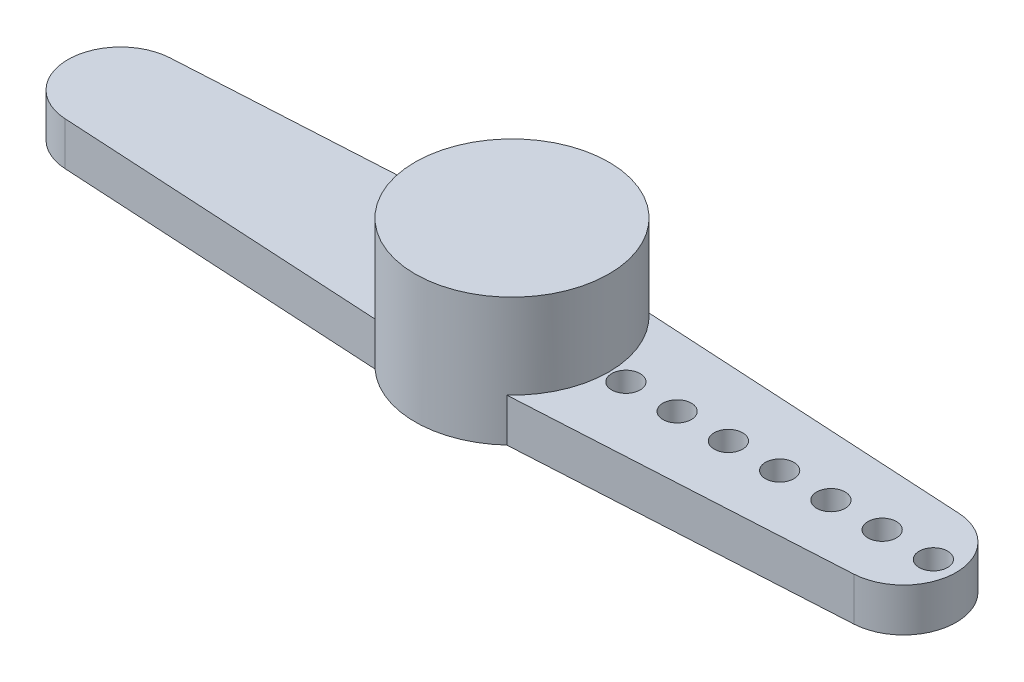
ISO-10303-21;
HEADER;
FILE_DESCRIPTION(('STEP AP214'),'2;1');
FILE_NAME('part.step','',(''),(''),'','','');
FILE_SCHEMA(('AUTOMOTIVE_DESIGN { 1 0 10303 214 1 1 1 1 }'));
ENDSEC;
DATA;
#1=APPLICATION_CONTEXT('core data for automotive mechanical design processes');
#2=APPLICATION_PROTOCOL_DEFINITION('international standard','automotive_design',2000,#1);
#3=PRODUCT_CONTEXT('',#1,'mechanical');
#4=PRODUCT('Part','Part','',(#3));
#5=PRODUCT_RELATED_PRODUCT_CATEGORY('part','',(#4));
#6=PRODUCT_DEFINITION_FORMATION('','',#4);
#7=PRODUCT_DEFINITION_CONTEXT('part definition',#1,'design');
#8=PRODUCT_DEFINITION('design','',#6,#7);
#9=PRODUCT_DEFINITION_SHAPE('','',#8);
#10=(LENGTH_UNIT() NAMED_UNIT(*) SI_UNIT(.MILLI.,.METRE.));
#11=(NAMED_UNIT(*) PLANE_ANGLE_UNIT() SI_UNIT($,.RADIAN.));
#12=(NAMED_UNIT(*) SI_UNIT($,.STERADIAN.) SOLID_ANGLE_UNIT());
#13=UNCERTAINTY_MEASURE_WITH_UNIT(LENGTH_MEASURE(1.E-05),#10,'distance_accuracy_value','');
#14=(GEOMETRIC_REPRESENTATION_CONTEXT(3) GLOBAL_UNCERTAINTY_ASSIGNED_CONTEXT((#13)) GLOBAL_UNIT_ASSIGNED_CONTEXT((#10,
#11,#12)) REPRESENTATION_CONTEXT('',''));
#15=CARTESIAN_POINT('',(0.,0.,0.));
#16=DIRECTION('',(0.,0.,1.));
#17=DIRECTION('',(1.,0.,0.));
#18=AXIS2_PLACEMENT_3D('',#15,#16,#17);
#19=CARTESIAN_POINT('',(0.,4.5,0.));
#20=DIRECTION('',(0.,-1.,0.));
#21=DIRECTION('',(0.,0.,-1.));
#22=AXIS2_PLACEMENT_3D('',#19,#20,#21);
#23=CYLINDRICAL_SURFACE('',#22,3.405);
#24=CARTESIAN_POINT('',(0.,1.52,0.));
#25=DIRECTION('',(0.,1.,0.));
#26=DIRECTION('',(0.,0.,1.));
#27=AXIS2_PLACEMENT_3D('',#24,#25,#26);
#28=CIRCLE('',#27,3.405);
#29=CARTESIAN_POINT('',(-2.31433990358498,1.52,-2.49756998113652));
#30=VERTEX_POINT('',#29);
#31=CARTESIAN_POINT('',(-2.31433990358498,1.52,2.49756998113652));
#32=VERTEX_POINT('',#31);
#33=EDGE_CURVE('E42',#30,#32,#28,.T.);
#34=ORIENTED_EDGE('',*,*,#33,.T.);
#35=DIRECTION('',(0.,-1.,0.));
#36=VECTOR('',#35,1.);
#37=CARTESIAN_POINT('',(-2.31433990358498,1.52,2.49756998113652));
#38=LINE('',#37,#36);
#39=CARTESIAN_POINT('',(-2.31433990358498,0.,2.49756998113652));
#40=VERTEX_POINT('',#39);
#41=EDGE_CURVE('E151',#32,#40,#38,.T.);
#42=ORIENTED_EDGE('',*,*,#41,.T.);
#43=CARTESIAN_POINT('',(0.,0.,0.));
#44=DIRECTION('',(0.,1.,0.));
#45=DIRECTION('',(0.,0.,1.));
#46=AXIS2_PLACEMENT_3D('',#43,#44,#45);
#47=CIRCLE('',#46,3.405);
#48=CARTESIAN_POINT('',(2.31433990358498,0.,2.49756998113652));
#49=VERTEX_POINT('',#48);
#50=EDGE_CURVE('E150',#40,#49,#47,.T.);
#51=ORIENTED_EDGE('',*,*,#50,.T.);
#52=DIRECTION('',(0.,-1.,0.));
#53=VECTOR('',#52,1.);
#54=CARTESIAN_POINT('',(2.31433990358498,1.52,2.49756998113652));
#55=LINE('',#54,#53);
#56=CARTESIAN_POINT('',(2.31433990358498,1.52,2.49756998113652));
#57=VERTEX_POINT('',#56);
#58=EDGE_CURVE('E154',#57,#49,#55,.T.);
#59=ORIENTED_EDGE('',*,*,#58,.F.);
#60=CARTESIAN_POINT('',(2.31433990358498,1.52,-2.49756998113652));
#61=VERTEX_POINT('',#60);
#62=EDGE_CURVE('E11',#57,#61,#28,.T.);
#63=ORIENTED_EDGE('',*,*,#62,.T.);
#64=DIRECTION('',(0.,-1.,0.));
#65=VECTOR('',#64,1.);
#66=CARTESIAN_POINT('',(2.31433990358498,1.52,-2.49756998113652));
#67=LINE('',#66,#65);
#68=CARTESIAN_POINT('',(2.31433990358498,0.,-2.49756998113652));
#69=VERTEX_POINT('',#68);
#70=EDGE_CURVE('E161',#61,#69,#67,.T.);
#71=ORIENTED_EDGE('',*,*,#70,.T.);
#72=CARTESIAN_POINT('',(-2.31433990358498,0.,-2.49756998113652));
#73=VERTEX_POINT('',#72);
#74=EDGE_CURVE('E166',#69,#73,#47,.T.);
#75=ORIENTED_EDGE('',*,*,#74,.T.);
#76=DIRECTION('',(0.,-1.,0.));
#77=VECTOR('',#76,1.);
#78=CARTESIAN_POINT('',(-2.31433990358498,1.52,-2.49756998113652));
#79=LINE('',#78,#77);
#80=EDGE_CURVE('E54',#30,#73,#79,.T.);
#81=ORIENTED_EDGE('',*,*,#80,.F.);
#82=EDGE_LOOP('',(#34,#42,#51,#59,#63,#71,#75,#81));
#83=FACE_BOUND('',#82,.T.);
#84=CARTESIAN_POINT('',(0.,4.5,0.));
#85=DIRECTION('',(0.,1.,0.));
#86=DIRECTION('',(0.,0.,1.));
#87=AXIS2_PLACEMENT_3D('',#84,#85,#86);
#88=CIRCLE('',#87,3.405);
#89=CARTESIAN_POINT('',(0.,4.5,3.405));
#90=VERTEX_POINT('',#89);
#91=EDGE_CURVE('E164',#90,#90,#88,.T.);
#92=ORIENTED_EDGE('',*,*,#91,.F.);
#93=EDGE_LOOP('',(#92));
#94=FACE_BOUND('',#93,.T.);
#95=ADVANCED_FACE('F35',(#83,#94),#23,.T.);
#96=CARTESIAN_POINT('',(0.,4.5,0.));
#97=DIRECTION('',(0.,1.,0.));
#98=DIRECTION('',(0.,0.,1.));
#99=AXIS2_PLACEMENT_3D('',#96,#97,#98);
#100=PLANE('',#99);
#101=ORIENTED_EDGE('',*,*,#91,.T.);
#102=EDGE_LOOP('',(#101));
#103=FACE_BOUND('',#102,.T.);
#104=ADVANCED_FACE('F188',(#103),#100,.T.);
#105=CARTESIAN_POINT('',(0.,0.,0.));
#106=DIRECTION('',(0.,1.,0.));
#107=DIRECTION('',(0.,0.,1.));
#108=AXIS2_PLACEMENT_3D('',#105,#106,#107);
#109=PLANE('',#108);
#110=CARTESIAN_POINT('',(14.8,0.,-1.1069736562738E-13));
#111=DIRECTION('',(0.,-1.,0.));
#112=DIRECTION('',(0.,0.,-1.));
#113=AXIS2_PLACEMENT_3D('',#110,#111,#112);
#114=CIRCLE('',#113,0.499999999999999);
#115=CARTESIAN_POINT('',(14.8,0.,-0.50000000000011));
#116=VERTEX_POINT('',#115);
#117=EDGE_CURVE('E356',#116,#116,#114,.T.);
#118=ORIENTED_EDGE('',*,*,#117,.F.);
#119=EDGE_LOOP('',(#118));
#120=FACE_BOUND('',#119,.T.);
#121=CARTESIAN_POINT('',(13.,0.,0.));
#122=DIRECTION('',(0.,-1.,0.));
#123=DIRECTION('',(0.,0.,-1.));
#124=AXIS2_PLACEMENT_3D('',#121,#122,#123);
#125=CIRCLE('',#124,0.499999999999999);
#126=CARTESIAN_POINT('',(13.,0.,-0.500000000000091));
#127=VERTEX_POINT('',#126);
#128=EDGE_CURVE('E358',#127,#127,#125,.T.);
#129=ORIENTED_EDGE('',*,*,#128,.F.);
#130=EDGE_LOOP('',(#129));
#131=FACE_BOUND('',#130,.T.);
#132=CARTESIAN_POINT('',(11.2,0.,0.));
#133=DIRECTION('',(0.,-1.,0.));
#134=DIRECTION('',(0.,0.,-1.));
#135=AXIS2_PLACEMENT_3D('',#132,#133,#134);
#136=CIRCLE('',#135,0.499999999999999);
#137=CARTESIAN_POINT('',(11.2,0.,-0.500000000000073));
#138=VERTEX_POINT('',#137);
#139=EDGE_CURVE('E364',#138,#138,#136,.T.);
#140=ORIENTED_EDGE('',*,*,#139,.F.);
#141=EDGE_LOOP('',(#140));
#142=FACE_BOUND('',#141,.T.);
#143=CARTESIAN_POINT('',(9.4,0.,0.));
#144=DIRECTION('',(0.,-1.,0.));
#145=DIRECTION('',(0.,0.,-1.));
#146=AXIS2_PLACEMENT_3D('',#143,#144,#145);
#147=CIRCLE('',#146,0.499999999999999);
#148=CARTESIAN_POINT('',(9.4,0.,-0.500000000000054));
#149=VERTEX_POINT('',#148);
#150=EDGE_CURVE('E370',#149,#149,#147,.T.);
#151=ORIENTED_EDGE('',*,*,#150,.F.);
#152=EDGE_LOOP('',(#151));
#153=FACE_BOUND('',#152,.T.);
#154=CARTESIAN_POINT('',(7.6,0.,0.));
#155=DIRECTION('',(0.,-1.,0.));
#156=DIRECTION('',(0.,0.,-1.));
#157=AXIS2_PLACEMENT_3D('',#154,#155,#156);
#158=CIRCLE('',#157,0.499999999999999);
#159=CARTESIAN_POINT('',(7.6,0.,-0.500000000000036));
#160=VERTEX_POINT('',#159);
#161=EDGE_CURVE('E376',#160,#160,#158,.T.);
#162=ORIENTED_EDGE('',*,*,#161,.F.);
#163=EDGE_LOOP('',(#162));
#164=FACE_BOUND('',#163,.T.);
#165=CARTESIAN_POINT('',(5.8,0.,0.));
#166=DIRECTION('',(0.,-1.,0.));
#167=DIRECTION('',(0.,0.,-1.));
#168=AXIS2_PLACEMENT_3D('',#165,#166,#167);
#169=CIRCLE('',#168,0.499999999999999);
#170=CARTESIAN_POINT('',(5.8,0.,-0.500000000000017));
#171=VERTEX_POINT('',#170);
#172=EDGE_CURVE('E382',#171,#171,#169,.T.);
#173=ORIENTED_EDGE('',*,*,#172,.F.);
#174=EDGE_LOOP('',(#173));
#175=FACE_BOUND('',#174,.T.);
#176=CARTESIAN_POINT('',(4.,0.,0.));
#177=DIRECTION('',(0.,-1.,0.));
#178=DIRECTION('',(0.,0.,-1.));
#179=AXIS2_PLACEMENT_3D('',#176,#177,#178);
#180=CIRCLE('',#179,0.499999999999999);
#181=CARTESIAN_POINT('',(4.,0.,-0.499999999999999));
#182=VERTEX_POINT('',#181);
#183=EDGE_CURVE('E125',#182,#182,#180,.T.);
#184=ORIENTED_EDGE('',*,*,#183,.F.);
#185=EDGE_LOOP('',(#184));
#186=FACE_BOUND('',#185,.T.);
#187=ORIENTED_EDGE('',*,*,#74,.F.);
#188=DIRECTION('',(0.998414964131182,0.,0.056281074962459));
#189=VECTOR('',#188,1.);
#190=CARTESIAN_POINT('',(2.31433990358498,0.,-2.49756998113652));
#191=LINE('',#190,#189);
#192=CARTESIAN_POINT('',(13.8541199886805,0.,-1.84706768364269));
#193=VERTEX_POINT('',#192);
#194=EDGE_CURVE('E141',#69,#193,#191,.T.);
#195=ORIENTED_EDGE('',*,*,#194,.T.);
#196=CARTESIAN_POINT('',(13.75,0.,0.));
#197=DIRECTION('',(0.,-1.,0.));
#198=DIRECTION('',(0.,0.,-1.));
#199=AXIS2_PLACEMENT_3D('',#196,#197,#198);
#200=CIRCLE('',#199,1.85);
#201=CARTESIAN_POINT('',(13.8541199886805,0.,1.84706768364269));
#202=VERTEX_POINT('',#201);
#203=EDGE_CURVE('E144',#193,#202,#200,.T.);
#204=ORIENTED_EDGE('',*,*,#203,.T.);
#205=DIRECTION('',(-0.998414964131182,0.,0.056281074962459));
#206=VECTOR('',#205,1.);
#207=CARTESIAN_POINT('',(2.31433990358498,0.,2.49756998113652));
#208=LINE('',#207,#206);
#209=EDGE_CURVE('E122',#202,#49,#208,.T.);
#210=ORIENTED_EDGE('',*,*,#209,.T.);
#211=ORIENTED_EDGE('',*,*,#50,.F.);
#212=DIRECTION('',(-0.998414964131182,0.,-0.056281074962459));
#213=VECTOR('',#212,1.);
#214=CARTESIAN_POINT('',(-2.31433990358498,0.,2.49756998113652));
#215=LINE('',#214,#213);
#216=CARTESIAN_POINT('',(-13.8541199886805,0.,1.84706768364269));
#217=VERTEX_POINT('',#216);
#218=EDGE_CURVE('E119',#40,#217,#215,.T.);
#219=ORIENTED_EDGE('',*,*,#218,.T.);
#220=CARTESIAN_POINT('',(-13.75,0.,0.));
#221=DIRECTION('',(0.,-1.,0.));
#222=DIRECTION('',(0.,0.,1.));
#223=AXIS2_PLACEMENT_3D('',#220,#221,#222);
#224=CIRCLE('',#223,1.85);
#225=CARTESIAN_POINT('',(-13.8541199886805,0.,-1.84706768364269));
#226=VERTEX_POINT('',#225);
#227=EDGE_CURVE('E137',#217,#226,#224,.T.);
#228=ORIENTED_EDGE('',*,*,#227,.T.);
#229=DIRECTION('',(0.998414964131182,0.,-0.056281074962459));
#230=VECTOR('',#229,1.);
#231=CARTESIAN_POINT('',(-2.31433990358498,0.,-2.49756998113652));
#232=LINE('',#231,#230);
#233=EDGE_CURVE('E102',#226,#73,#232,.T.);
#234=ORIENTED_EDGE('',*,*,#233,.T.);
#235=EDGE_LOOP('',(#187,#195,#204,#210,#211,#219,#228,#234));
#236=FACE_BOUND('',#235,.T.);
#237=ADVANCED_FACE('F170',(#120,#131,#142,#153,#164,#175,#186,#236),#109,.F.);
#238=CARTESIAN_POINT('',(-13.75,1.52,0.));
#239=DIRECTION('',(0.,-1.,0.));
#240=DIRECTION('',(0.,0.,-1.));
#241=AXIS2_PLACEMENT_3D('',#238,#239,#240);
#242=CYLINDRICAL_SURFACE('',#241,1.85);
#243=ORIENTED_EDGE('',*,*,#227,.F.);
#244=DIRECTION('',(0.,-1.,0.));
#245=VECTOR('',#244,1.);
#246=CARTESIAN_POINT('',(-13.8541199886805,1.52,1.84706768364269));
#247=LINE('',#246,#245);
#248=CARTESIAN_POINT('',(-13.8541199886805,1.52,1.84706768364269));
#249=VERTEX_POINT('',#248);
#250=EDGE_CURVE('E118',#249,#217,#247,.T.);
#251=ORIENTED_EDGE('',*,*,#250,.F.);
#252=CARTESIAN_POINT('',(-13.75,1.52,0.));
#253=DIRECTION('',(0.,-1.,0.));
#254=DIRECTION('',(0.,0.,1.));
#255=AXIS2_PLACEMENT_3D('',#252,#253,#254);
#256=CIRCLE('',#255,1.85);
#257=CARTESIAN_POINT('',(-13.8541199886805,1.52,-1.84706768364269));
#258=VERTEX_POINT('',#257);
#259=EDGE_CURVE('E113',#249,#258,#256,.T.);
#260=ORIENTED_EDGE('',*,*,#259,.T.);
#261=DIRECTION('',(0.,-1.,0.));
#262=VECTOR('',#261,1.);
#263=CARTESIAN_POINT('',(-13.8541199886805,1.52,-1.84706768364269));
#264=LINE('',#263,#262);
#265=EDGE_CURVE('E97',#258,#226,#264,.T.);
#266=ORIENTED_EDGE('',*,*,#265,.T.);
#267=EDGE_LOOP('',(#243,#251,#260,#266));
#268=FACE_BOUND('',#267,.T.);
#269=ADVANCED_FACE('F117',(#268),#242,.T.);
#270=CARTESIAN_POINT('',(-13.75,1.52,0.));
#271=DIRECTION('',(0.,1.,0.));
#272=DIRECTION('',(0.,0.,1.));
#273=AXIS2_PLACEMENT_3D('',#270,#271,#272);
#274=PLANE('',#273);
#275=ORIENTED_EDGE('',*,*,#33,.F.);
#276=DIRECTION('',(0.998414964131182,0.,-0.056281074962459));
#277=VECTOR('',#276,1.);
#278=CARTESIAN_POINT('',(-2.31433990358498,1.52,-2.49756998113652));
#279=LINE('',#278,#277);
#280=EDGE_CURVE('E100',#258,#30,#279,.T.);
#281=ORIENTED_EDGE('',*,*,#280,.F.);
#282=ORIENTED_EDGE('',*,*,#259,.F.);
#283=DIRECTION('',(-0.998414964131182,0.,-0.056281074962459));
#284=VECTOR('',#283,1.);
#285=CARTESIAN_POINT('',(-2.31433990358498,1.52,2.49756998113652));
#286=LINE('',#285,#284);
#287=EDGE_CURVE('E107',#32,#249,#286,.T.);
#288=ORIENTED_EDGE('',*,*,#287,.F.);
#289=EDGE_LOOP('',(#275,#281,#282,#288));
#290=FACE_BOUND('',#289,.T.);
#291=ADVANCED_FACE('F111',(#290),#274,.T.);
#292=CARTESIAN_POINT('',(-2.31433990358498,1.52,-2.49756998113652));
#293=DIRECTION('',(-0.056281074962459,0.,-0.998414964131182));
#294=DIRECTION('',(-0.998414964131182,0.,0.056281074962459));
#295=AXIS2_PLACEMENT_3D('',#292,#293,#294);
#296=PLANE('',#295);
#297=ORIENTED_EDGE('',*,*,#233,.F.);
#298=ORIENTED_EDGE('',*,*,#265,.F.);
#299=ORIENTED_EDGE('',*,*,#280,.T.);
#300=ORIENTED_EDGE('',*,*,#80,.T.);
#301=EDGE_LOOP('',(#297,#298,#299,#300));
#302=FACE_BOUND('',#301,.T.);
#303=ADVANCED_FACE('F99',(#302),#296,.T.);
#304=CARTESIAN_POINT('',(-2.31433990358498,1.52,2.49756998113652));
#305=DIRECTION('',(-0.056281074962459,0.,0.998414964131182));
#306=DIRECTION('',(0.998414964131182,0.,0.056281074962459));
#307=AXIS2_PLACEMENT_3D('',#304,#305,#306);
#308=PLANE('',#307);
#309=ORIENTED_EDGE('',*,*,#218,.F.);
#310=ORIENTED_EDGE('',*,*,#41,.F.);
#311=ORIENTED_EDGE('',*,*,#287,.T.);
#312=ORIENTED_EDGE('',*,*,#250,.T.);
#313=EDGE_LOOP('',(#309,#310,#311,#312));
#314=FACE_BOUND('',#313,.T.);
#315=ADVANCED_FACE('F174',(#314),#308,.T.);
#316=CARTESIAN_POINT('',(14.8,1.52,-1.1069736562738E-13));
#317=DIRECTION('',(0.,-1.,0.));
#318=DIRECTION('',(0.,0.,-1.));
#319=AXIS2_PLACEMENT_3D('',#316,#317,#318);
#320=CIRCLE('',#319,0.499999999999999);
#321=CARTESIAN_POINT('',(14.8,1.52,-0.50000000000011));
#322=VERTEX_POINT('',#321);
#323=EDGE_CURVE('E353',#322,#322,#320,.T.);
#324=ORIENTED_EDGE('',*,*,#323,.T.);
#325=EDGE_LOOP('',(#324));
#326=FACE_BOUND('',#325,.T.);
#327=CARTESIAN_POINT('',(13.,1.52,0.));
#328=DIRECTION('',(0.,-1.,0.));
#329=DIRECTION('',(0.,0.,-1.));
#330=AXIS2_PLACEMENT_3D('',#327,#328,#329);
#331=CIRCLE('',#330,0.499999999999999);
#332=CARTESIAN_POINT('',(13.,1.52,-0.500000000000091));
#333=VERTEX_POINT('',#332);
#334=EDGE_CURVE('E361',#333,#333,#331,.T.);
#335=ORIENTED_EDGE('',*,*,#334,.T.);
#336=EDGE_LOOP('',(#335));
#337=FACE_BOUND('',#336,.T.);
#338=CARTESIAN_POINT('',(11.2,1.52,0.));
#339=DIRECTION('',(0.,-1.,0.));
#340=DIRECTION('',(0.,0.,-1.));
#341=AXIS2_PLACEMENT_3D('',#338,#339,#340);
#342=CIRCLE('',#341,0.499999999999999);
#343=CARTESIAN_POINT('',(11.2,1.52,-0.500000000000073));
#344=VERTEX_POINT('',#343);
#345=EDGE_CURVE('E367',#344,#344,#342,.T.);
#346=ORIENTED_EDGE('',*,*,#345,.T.);
#347=EDGE_LOOP('',(#346));
#348=FACE_BOUND('',#347,.T.);
#349=CARTESIAN_POINT('',(9.4,1.52,0.));
#350=DIRECTION('',(0.,-1.,0.));
#351=DIRECTION('',(0.,0.,-1.));
#352=AXIS2_PLACEMENT_3D('',#349,#350,#351);
#353=CIRCLE('',#352,0.499999999999999);
#354=CARTESIAN_POINT('',(9.4,1.52,-0.500000000000054));
#355=VERTEX_POINT('',#354);
#356=EDGE_CURVE('E373',#355,#355,#353,.T.);
#357=ORIENTED_EDGE('',*,*,#356,.T.);
#358=EDGE_LOOP('',(#357));
#359=FACE_BOUND('',#358,.T.);
#360=CARTESIAN_POINT('',(7.6,1.52,0.));
#361=DIRECTION('',(0.,-1.,0.));
#362=DIRECTION('',(0.,0.,-1.));
#363=AXIS2_PLACEMENT_3D('',#360,#361,#362);
#364=CIRCLE('',#363,0.499999999999999);
#365=CARTESIAN_POINT('',(7.6,1.52,-0.500000000000036));
#366=VERTEX_POINT('',#365);
#367=EDGE_CURVE('E379',#366,#366,#364,.T.);
#368=ORIENTED_EDGE('',*,*,#367,.T.);
#369=EDGE_LOOP('',(#368));
#370=FACE_BOUND('',#369,.T.);
#371=CARTESIAN_POINT('',(5.8,1.52,0.));
#372=DIRECTION('',(0.,-1.,0.));
#373=DIRECTION('',(0.,0.,-1.));
#374=AXIS2_PLACEMENT_3D('',#371,#372,#373);
#375=CIRCLE('',#374,0.499999999999999);
#376=CARTESIAN_POINT('',(5.8,1.52,-0.500000000000017));
#377=VERTEX_POINT('',#376);
#378=EDGE_CURVE('E385',#377,#377,#375,.T.);
#379=ORIENTED_EDGE('',*,*,#378,.T.);
#380=EDGE_LOOP('',(#379));
#381=FACE_BOUND('',#380,.T.);
#382=CARTESIAN_POINT('',(4.,1.52,0.));
#383=DIRECTION('',(0.,-1.,0.));
#384=DIRECTION('',(0.,0.,-1.));
#385=AXIS2_PLACEMENT_3D('',#382,#383,#384);
#386=CIRCLE('',#385,0.499999999999999);
#387=CARTESIAN_POINT('',(4.,1.52,-0.499999999999999));
#388=VERTEX_POINT('',#387);
#389=EDGE_CURVE('E139',#388,#388,#386,.T.);
#390=ORIENTED_EDGE('',*,*,#389,.T.);
#391=EDGE_LOOP('',(#390));
#392=FACE_BOUND('',#391,.T.);
#393=ORIENTED_EDGE('',*,*,#62,.F.);
#394=DIRECTION('',(-0.998414964131182,0.,0.056281074962459));
#395=VECTOR('',#394,1.);
#396=CARTESIAN_POINT('',(2.31433990358498,1.52,2.49756998113652));
#397=LINE('',#396,#395);
#398=CARTESIAN_POINT('',(13.8541199886805,1.52,1.84706768364269));
#399=VERTEX_POINT('',#398);
#400=EDGE_CURVE('E133',#399,#57,#397,.T.);
#401=ORIENTED_EDGE('',*,*,#400,.F.);
#402=CARTESIAN_POINT('',(13.75,1.52,0.));
#403=DIRECTION('',(0.,-1.,0.));
#404=DIRECTION('',(0.,0.,-1.));
#405=AXIS2_PLACEMENT_3D('',#402,#403,#404);
#406=CIRCLE('',#405,1.85);
#407=CARTESIAN_POINT('',(13.8541199886805,1.52,-1.84706768364269));
#408=VERTEX_POINT('',#407);
#409=EDGE_CURVE('E130',#408,#399,#406,.T.);
#410=ORIENTED_EDGE('',*,*,#409,.F.);
#411=DIRECTION('',(0.998414964131182,0.,0.056281074962459));
#412=VECTOR('',#411,1.);
#413=CARTESIAN_POINT('',(2.31433990358498,1.52,-2.49756998113652));
#414=LINE('',#413,#412);
#415=EDGE_CURVE('E115',#61,#408,#414,.T.);
#416=ORIENTED_EDGE('',*,*,#415,.F.);
#417=EDGE_LOOP('',(#393,#401,#410,#416));
#418=FACE_BOUND('',#417,.T.);
#419=ADVANCED_FACE('F176',(#326,#337,#348,#359,#370,#381,#392,#418),#274,.T.);
#420=CARTESIAN_POINT('',(2.31433990358498,1.52,2.49756998113652));
#421=DIRECTION('',(0.056281074962459,0.,0.998414964131182));
#422=DIRECTION('',(0.998414964131182,0.,-0.056281074962459));
#423=AXIS2_PLACEMENT_3D('',#420,#421,#422);
#424=PLANE('',#423);
#425=ORIENTED_EDGE('',*,*,#209,.F.);
#426=DIRECTION('',(0.,-1.,0.));
#427=VECTOR('',#426,1.);
#428=CARTESIAN_POINT('',(13.8541199886805,1.52,1.84706768364269));
#429=LINE('',#428,#427);
#430=EDGE_CURVE('E157',#399,#202,#429,.T.);
#431=ORIENTED_EDGE('',*,*,#430,.F.);
#432=ORIENTED_EDGE('',*,*,#400,.T.);
#433=ORIENTED_EDGE('',*,*,#58,.T.);
#434=EDGE_LOOP('',(#425,#431,#432,#433));
#435=FACE_BOUND('',#434,.T.);
#436=ADVANCED_FACE('F182',(#435),#424,.T.);
#437=CARTESIAN_POINT('',(13.75,1.52,0.));
#438=DIRECTION('',(0.,-1.,0.));
#439=DIRECTION('',(0.,0.,-1.));
#440=AXIS2_PLACEMENT_3D('',#437,#438,#439);
#441=CYLINDRICAL_SURFACE('',#440,1.85);
#442=ORIENTED_EDGE('',*,*,#203,.F.);
#443=DIRECTION('',(0.,-1.,0.));
#444=VECTOR('',#443,1.);
#445=CARTESIAN_POINT('',(13.8541199886805,1.52,-1.84706768364269));
#446=LINE('',#445,#444);
#447=EDGE_CURVE('E159',#408,#193,#446,.T.);
#448=ORIENTED_EDGE('',*,*,#447,.F.);
#449=ORIENTED_EDGE('',*,*,#409,.T.);
#450=ORIENTED_EDGE('',*,*,#430,.T.);
#451=EDGE_LOOP('',(#442,#448,#449,#450));
#452=FACE_BOUND('',#451,.T.);
#453=ADVANCED_FACE('F205',(#452),#441,.T.);
#454=CARTESIAN_POINT('',(2.31433990358498,1.52,-2.49756998113652));
#455=DIRECTION('',(0.056281074962459,0.,-0.998414964131182));
#456=DIRECTION('',(-0.998414964131182,0.,-0.056281074962459));
#457=AXIS2_PLACEMENT_3D('',#454,#455,#456);
#458=PLANE('',#457);
#459=ORIENTED_EDGE('',*,*,#194,.F.);
#460=ORIENTED_EDGE('',*,*,#70,.F.);
#461=ORIENTED_EDGE('',*,*,#415,.T.);
#462=ORIENTED_EDGE('',*,*,#447,.T.);
#463=EDGE_LOOP('',(#459,#460,#461,#462));
#464=FACE_BOUND('',#463,.T.);
#465=ADVANCED_FACE('F201',(#464),#458,.T.);
#466=CARTESIAN_POINT('',(4.,1.52,0.));
#467=DIRECTION('',(0.,-1.,0.));
#468=DIRECTION('',(0.,0.,-1.));
#469=AXIS2_PLACEMENT_3D('',#466,#467,#468);
#470=CYLINDRICAL_SURFACE('',#469,0.499999999999999);
#471=ORIENTED_EDGE('',*,*,#389,.F.);
#472=EDGE_LOOP('',(#471));
#473=FACE_BOUND('',#472,.T.);
#474=ORIENTED_EDGE('',*,*,#183,.T.);
#475=EDGE_LOOP('',(#474));
#476=FACE_BOUND('',#475,.T.);
#477=ADVANCED_FACE('F204',(#473,#476),#470,.F.);
#478=CARTESIAN_POINT('',(5.8,1.52,0.));
#479=DIRECTION('',(0.,-1.,0.));
#480=DIRECTION('',(0.,0.,-1.));
#481=AXIS2_PLACEMENT_3D('',#478,#479,#480);
#482=CYLINDRICAL_SURFACE('',#481,0.499999999999999);
#483=ORIENTED_EDGE('',*,*,#378,.F.);
#484=EDGE_LOOP('',(#483));
#485=FACE_BOUND('',#484,.T.);
#486=ORIENTED_EDGE('',*,*,#172,.T.);
#487=EDGE_LOOP('',(#486));
#488=FACE_BOUND('',#487,.T.);
#489=ADVANCED_FACE('F236',(#485,#488),#482,.F.);
#490=CARTESIAN_POINT('',(7.6,1.52,0.));
#491=DIRECTION('',(0.,-1.,0.));
#492=DIRECTION('',(0.,0.,-1.));
#493=AXIS2_PLACEMENT_3D('',#490,#491,#492);
#494=CYLINDRICAL_SURFACE('',#493,0.499999999999999);
#495=ORIENTED_EDGE('',*,*,#367,.F.);
#496=EDGE_LOOP('',(#495));
#497=FACE_BOUND('',#496,.T.);
#498=ORIENTED_EDGE('',*,*,#161,.T.);
#499=EDGE_LOOP('',(#498));
#500=FACE_BOUND('',#499,.T.);
#501=ADVANCED_FACE('F244',(#497,#500),#494,.F.);
#502=CARTESIAN_POINT('',(9.4,1.52,0.));
#503=DIRECTION('',(0.,-1.,0.));
#504=DIRECTION('',(0.,0.,-1.));
#505=AXIS2_PLACEMENT_3D('',#502,#503,#504);
#506=CYLINDRICAL_SURFACE('',#505,0.499999999999999);
#507=ORIENTED_EDGE('',*,*,#356,.F.);
#508=EDGE_LOOP('',(#507));
#509=FACE_BOUND('',#508,.T.);
#510=ORIENTED_EDGE('',*,*,#150,.T.);
#511=EDGE_LOOP('',(#510));
#512=FACE_BOUND('',#511,.T.);
#513=ADVANCED_FACE('F252',(#509,#512),#506,.F.);
#514=CARTESIAN_POINT('',(11.2,1.52,0.));
#515=DIRECTION('',(0.,-1.,0.));
#516=DIRECTION('',(0.,0.,-1.));
#517=AXIS2_PLACEMENT_3D('',#514,#515,#516);
#518=CYLINDRICAL_SURFACE('',#517,0.499999999999999);
#519=ORIENTED_EDGE('',*,*,#345,.F.);
#520=EDGE_LOOP('',(#519));
#521=FACE_BOUND('',#520,.T.);
#522=ORIENTED_EDGE('',*,*,#139,.T.);
#523=EDGE_LOOP('',(#522));
#524=FACE_BOUND('',#523,.T.);
#525=ADVANCED_FACE('F260',(#521,#524),#518,.F.);
#526=CARTESIAN_POINT('',(13.,1.52,0.));
#527=DIRECTION('',(0.,-1.,0.));
#528=DIRECTION('',(0.,0.,-1.));
#529=AXIS2_PLACEMENT_3D('',#526,#527,#528);
#530=CYLINDRICAL_SURFACE('',#529,0.499999999999999);
#531=ORIENTED_EDGE('',*,*,#334,.F.);
#532=EDGE_LOOP('',(#531));
#533=FACE_BOUND('',#532,.T.);
#534=ORIENTED_EDGE('',*,*,#128,.T.);
#535=EDGE_LOOP('',(#534));
#536=FACE_BOUND('',#535,.T.);
#537=ADVANCED_FACE('F268',(#533,#536),#530,.F.);
#538=CARTESIAN_POINT('',(14.8,1.52,-1.1069736562738E-13));
#539=DIRECTION('',(0.,-1.,0.));
#540=DIRECTION('',(0.,0.,-1.));
#541=AXIS2_PLACEMENT_3D('',#538,#539,#540);
#542=CYLINDRICAL_SURFACE('',#541,0.499999999999999);
#543=ORIENTED_EDGE('',*,*,#323,.F.);
#544=EDGE_LOOP('',(#543));
#545=FACE_BOUND('',#544,.T.);
#546=ORIENTED_EDGE('',*,*,#117,.T.);
#547=EDGE_LOOP('',(#546));
#548=FACE_BOUND('',#547,.T.);
#549=ADVANCED_FACE('F276',(#545,#548),#542,.F.);
#550=CLOSED_SHELL('',(#95,#104,#237,#269,#291,#303,#315,#419,#436,#453,#465,#477,#489,#501,#513,
#525,#537,#549));
#551=MANIFOLD_SOLID_BREP('B2',#550);
#552=ADVANCED_BREP_SHAPE_REPRESENTATION('',(#18,#551),#14);
#553=SHAPE_DEFINITION_REPRESENTATION(#9,#552);
ENDSEC;
END-ISO-10303-21;
